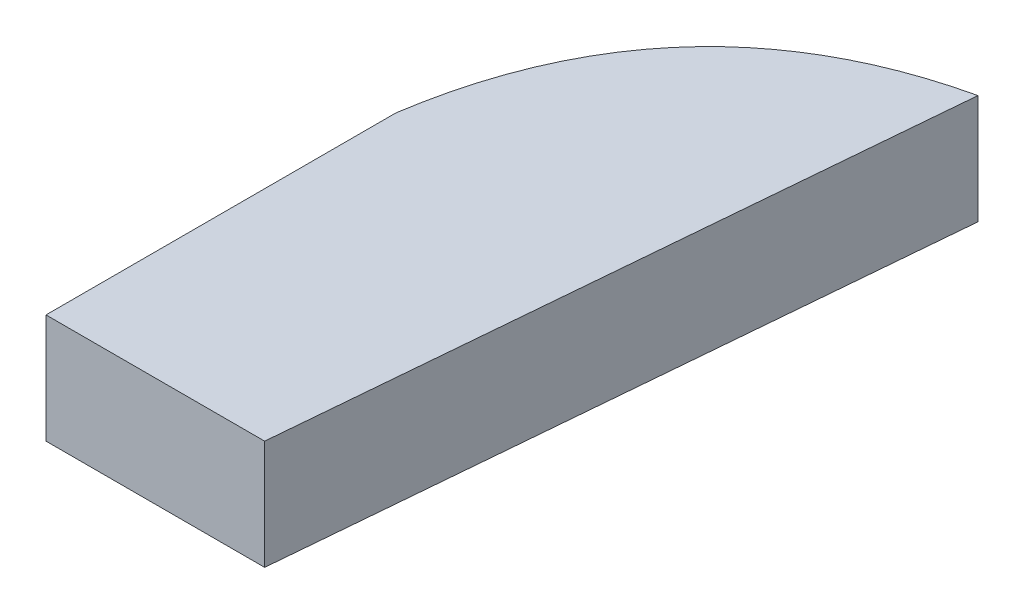
ISO-10303-21;
HEADER;
FILE_DESCRIPTION(('STEP AP214'),'2;1');
FILE_NAME('part.step','',(''),(''),'','','');
FILE_SCHEMA(('AUTOMOTIVE_DESIGN { 1 0 10303 214 1 1 1 1 }'));
ENDSEC;
DATA;
#1=APPLICATION_CONTEXT('core data for automotive mechanical design processes');
#2=APPLICATION_PROTOCOL_DEFINITION('international standard','automotive_design',2000,#1);
#3=PRODUCT_CONTEXT('',#1,'mechanical');
#4=PRODUCT('Part','Part','',(#3));
#5=PRODUCT_RELATED_PRODUCT_CATEGORY('part','',(#4));
#6=PRODUCT_DEFINITION_FORMATION('','',#4);
#7=PRODUCT_DEFINITION_CONTEXT('part definition',#1,'design');
#8=PRODUCT_DEFINITION('design','',#6,#7);
#9=PRODUCT_DEFINITION_SHAPE('','',#8);
#10=(LENGTH_UNIT() NAMED_UNIT(*) SI_UNIT(.MILLI.,.METRE.));
#11=(NAMED_UNIT(*) PLANE_ANGLE_UNIT() SI_UNIT($,.RADIAN.));
#12=(NAMED_UNIT(*) SI_UNIT($,.STERADIAN.) SOLID_ANGLE_UNIT());
#13=UNCERTAINTY_MEASURE_WITH_UNIT(LENGTH_MEASURE(1.E-05),#10,'distance_accuracy_value','');
#14=(GEOMETRIC_REPRESENTATION_CONTEXT(3) GLOBAL_UNCERTAINTY_ASSIGNED_CONTEXT((#13)) GLOBAL_UNIT_ASSIGNED_CONTEXT((#10,
#11,#12)) REPRESENTATION_CONTEXT('',''));
#15=CARTESIAN_POINT('',(0.,0.,0.));
#16=DIRECTION('',(0.,0.,1.));
#17=DIRECTION('',(1.,0.,0.));
#18=AXIS2_PLACEMENT_3D('',#15,#16,#17);
#19=CARTESIAN_POINT('',(712302.692178624,-82.0000000000778,701866.86554448));
#20=CARTESIAN_POINT('',(-708587.743596188,-81.9999999999218,-705647.949112223));
#21=CARTESIAN_POINT('',(704890.818239483,-82.0000000000786,709309.979303103));
#22=B_SPLINE_CURVE_WITH_KNOTS('',2,(#19,#20,#21),.UNSPECIFIED.,.F.,.F.,(3,3),(0.,1.),.UNSPECIFIED.);
#23=DIRECTION('',(0.,-1.,0.));
#24=VECTOR('',#23,1.);
#25=SURFACE_OF_LINEAR_EXTRUSION('',#22,#24);
#26=CARTESIAN_POINT('',(712302.692178624,-87.0000000000778,701866.86554448));
#27=CARTESIAN_POINT('',(-708587.743596188,-86.9999999999218,-705647.949112223));
#28=CARTESIAN_POINT('',(704890.818239483,-87.0000000000786,709309.979303103));
#29=B_SPLINE_CURVE_WITH_KNOTS('',2,(#26,#27,#28),.UNSPECIFIED.,.F.,.F.,(3,3),(0.,1.),.UNSPECIFIED.);
#30=CARTESIAN_POINT('',(12.624659909998,-87.,-33.9999999999994));
#31=VERTEX_POINT('',#30);
#32=CARTESIAN_POINT('',(-1.83013326715553E-12,-87.,-19.9999999999994));
#33=VERTEX_POINT('',#32);
#34=EDGE_CURVE('E97',#31,#33,#29,.T.);
#35=ORIENTED_EDGE('',*,*,#34,.T.);
#36=DIRECTION('',(0.,-1.,0.));
#37=VECTOR('',#36,1.);
#38=CARTESIAN_POINT('',(-1.83013326715553E-12,-82.,-19.9999999999994));
#39=LINE('',#38,#37);
#40=CARTESIAN_POINT('',(-1.83013326715553E-12,-82.,-19.9999999999994));
#41=VERTEX_POINT('',#40);
#42=EDGE_CURVE('E11',#41,#33,#39,.T.);
#43=ORIENTED_EDGE('',*,*,#42,.F.);
#44=CARTESIAN_POINT('',(12.624659909998,-82.,-33.9999999999994));
#45=VERTEX_POINT('',#44);
#46=EDGE_CURVE('E86',#45,#41,#22,.T.);
#47=ORIENTED_EDGE('',*,*,#46,.F.);
#48=DIRECTION('',(0.,-1.,0.));
#49=VECTOR('',#48,1.);
#50=CARTESIAN_POINT('',(12.624659909998,-82.,-33.9999999999994));
#51=LINE('',#50,#49);
#52=EDGE_CURVE('E94',#45,#31,#51,.T.);
#53=ORIENTED_EDGE('',*,*,#52,.T.);
#54=EDGE_LOOP('',(#35,#43,#47,#53));
#55=FACE_BOUND('',#54,.T.);
#56=ADVANCED_FACE('F34',(#55),#25,.F.);
#57=CARTESIAN_POINT('',(-1.83013326715553E-12,-82.,-19.9999999999994));
#58=DIRECTION('',(1.,0.,0.));
#59=DIRECTION('',(0.,0.,-1.));
#60=AXIS2_PLACEMENT_3D('',#57,#58,#59);
#61=PLANE('',#60);
#62=DIRECTION('',(0.,0.,1.));
#63=VECTOR('',#62,1.);
#64=CARTESIAN_POINT('',(-1.83013326715553E-12,-87.,-19.9999999999994));
#65=LINE('',#64,#63);
#66=CARTESIAN_POINT('',(-2.08253553291016E-12,-87.,-3.9999999999994));
#67=VERTEX_POINT('',#66);
#68=EDGE_CURVE('E90',#33,#67,#65,.T.);
#69=ORIENTED_EDGE('',*,*,#68,.T.);
#70=DIRECTION('',(0.,-1.,0.));
#71=VECTOR('',#70,1.);
#72=CARTESIAN_POINT('',(-2.08166817117217E-12,-82.,-3.9999999999994));
#73=LINE('',#72,#71);
#74=CARTESIAN_POINT('',(-2.08166817117217E-12,-82.,-3.9999999999994));
#75=VERTEX_POINT('',#74);
#76=EDGE_CURVE('E43',#75,#67,#73,.T.);
#77=ORIENTED_EDGE('',*,*,#76,.F.);
#78=DIRECTION('',(0.,0.,1.));
#79=VECTOR('',#78,1.);
#80=CARTESIAN_POINT('',(-1.83013326715553E-12,-82.,-19.9999999999994));
#81=LINE('',#80,#79);
#82=EDGE_CURVE('E81',#41,#75,#81,.T.);
#83=ORIENTED_EDGE('',*,*,#82,.F.);
#84=ORIENTED_EDGE('',*,*,#42,.T.);
#85=EDGE_LOOP('',(#69,#77,#83,#84));
#86=FACE_BOUND('',#85,.T.);
#87=ADVANCED_FACE('F89',(#86),#61,.F.);
#88=CARTESIAN_POINT('',(-2.08166817117217E-12,-82.,-3.9999999999994));
#89=DIRECTION('',(0.,0.,-1.));
#90=DIRECTION('',(-1.,0.,0.));
#91=AXIS2_PLACEMENT_3D('',#88,#89,#90);
#92=PLANE('',#91);
#93=DIRECTION('',(1.,0.,0.));
#94=VECTOR('',#93,1.);
#95=CARTESIAN_POINT('',(-2.08253553291016E-12,-87.,-3.9999999999994));
#96=LINE('',#95,#94);
#97=CARTESIAN_POINT('',(9.99999999999794,-87.,-3.9999999999994));
#98=VERTEX_POINT('',#97);
#99=EDGE_CURVE('E68',#67,#98,#96,.T.);
#100=ORIENTED_EDGE('',*,*,#99,.T.);
#101=DIRECTION('',(0.,-1.,0.));
#102=VECTOR('',#101,1.);
#103=CARTESIAN_POINT('',(9.99999999999794,-82.,-3.9999999999994));
#104=LINE('',#103,#102);
#105=CARTESIAN_POINT('',(9.99999999999794,-82.,-3.9999999999994));
#106=VERTEX_POINT('',#105);
#107=EDGE_CURVE('E91',#106,#98,#104,.T.);
#108=ORIENTED_EDGE('',*,*,#107,.F.);
#109=DIRECTION('',(1.,0.,0.));
#110=VECTOR('',#109,1.);
#111=CARTESIAN_POINT('',(-2.08166817117217E-12,-82.,-3.9999999999994));
#112=LINE('',#111,#110);
#113=EDGE_CURVE('E84',#75,#106,#112,.T.);
#114=ORIENTED_EDGE('',*,*,#113,.F.);
#115=ORIENTED_EDGE('',*,*,#76,.T.);
#116=EDGE_LOOP('',(#100,#108,#114,#115));
#117=FACE_BOUND('',#116,.T.);
#118=ADVANCED_FACE('F92',(#117),#92,.F.);
#119=CARTESIAN_POINT('',(9.99999999999794,-82.,-3.9999999999994));
#120=DIRECTION('',(-0.996194698079572,0.,-0.0871557428868004));
#121=DIRECTION('',(-0.0871557428868005,0.,0.996194698079572));
#122=AXIS2_PLACEMENT_3D('',#119,#120,#121);
#123=PLANE('',#122);
#124=DIRECTION('',(0.0871557428868005,0.,-0.996194698079572));
#125=VECTOR('',#124,1.);
#126=CARTESIAN_POINT('',(9.99999999999794,-87.,-3.9999999999994));
#127=LINE('',#126,#125);
#128=EDGE_CURVE('E74',#98,#31,#127,.T.);
#129=ORIENTED_EDGE('',*,*,#128,.T.);
#130=ORIENTED_EDGE('',*,*,#52,.F.);
#131=DIRECTION('',(0.0871557428868005,0.,-0.996194698079572));
#132=VECTOR('',#131,1.);
#133=CARTESIAN_POINT('',(9.99999999999794,-82.,-3.9999999999994));
#134=LINE('',#133,#132);
#135=EDGE_CURVE('E51',#106,#45,#134,.T.);
#136=ORIENTED_EDGE('',*,*,#135,.F.);
#137=ORIENTED_EDGE('',*,*,#107,.T.);
#138=EDGE_LOOP('',(#129,#130,#136,#137));
#139=FACE_BOUND('',#138,.T.);
#140=ADVANCED_FACE('F109',(#139),#123,.F.);
#141=CARTESIAN_POINT('',(4.50580643271792,-82.,-29.7633442157519));
#142=DIRECTION('',(0.,-1.,0.));
#143=DIRECTION('',(0.,0.,-1.));
#144=AXIS2_PLACEMENT_3D('',#141,#142,#143);
#145=PLANE('',#144);
#146=ORIENTED_EDGE('',*,*,#46,.T.);
#147=ORIENTED_EDGE('',*,*,#82,.T.);
#148=ORIENTED_EDGE('',*,*,#113,.T.);
#149=ORIENTED_EDGE('',*,*,#135,.T.);
#150=EDGE_LOOP('',(#146,#147,#148,#149));
#151=FACE_BOUND('',#150,.T.);
#152=ADVANCED_FACE('F82',(#151),#145,.F.);
#153=CARTESIAN_POINT('',(4.50580643271792,-87.,-29.7633442157519));
#154=DIRECTION('',(0.,-1.,0.));
#155=DIRECTION('',(0.,0.,-1.));
#156=AXIS2_PLACEMENT_3D('',#153,#154,#155);
#157=PLANE('',#156);
#158=ORIENTED_EDGE('',*,*,#34,.F.);
#159=ORIENTED_EDGE('',*,*,#128,.F.);
#160=ORIENTED_EDGE('',*,*,#99,.F.);
#161=ORIENTED_EDGE('',*,*,#68,.F.);
#162=EDGE_LOOP('',(#158,#159,#160,#161));
#163=FACE_BOUND('',#162,.T.);
#164=ADVANCED_FACE('F112',(#163),#157,.T.);
#165=CLOSED_SHELL('',(#56,#87,#118,#140,#152,#164));
#166=MANIFOLD_SOLID_BREP('B2',#165);
#167=ADVANCED_BREP_SHAPE_REPRESENTATION('',(#18,#166),#14);
#168=SHAPE_DEFINITION_REPRESENTATION(#9,#167);
ENDSEC;
END-ISO-10303-21;
